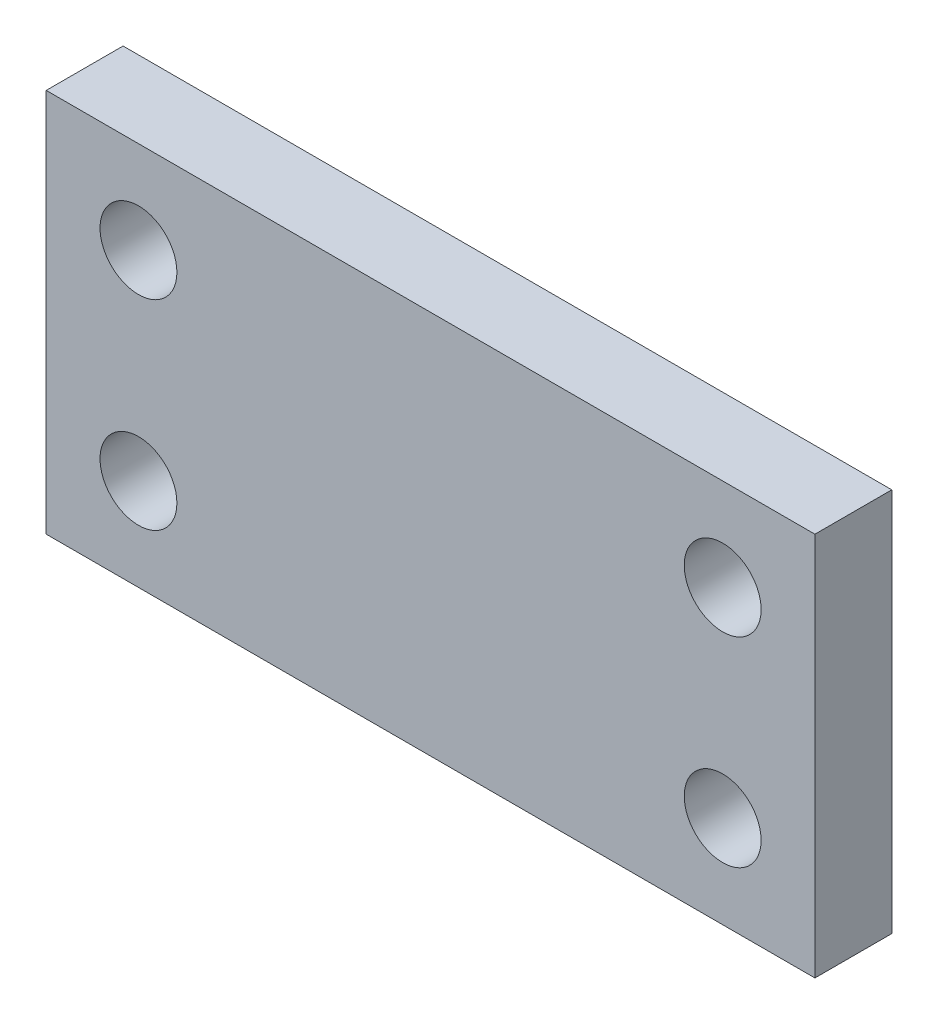
ISO-10303-21;
HEADER;
FILE_DESCRIPTION(('STEP AP214'),'2;1');
FILE_NAME('part.step','',(''),(''),'','','');
FILE_SCHEMA(('AUTOMOTIVE_DESIGN { 1 0 10303 214 1 1 1 1 }'));
ENDSEC;
DATA;
#1=APPLICATION_CONTEXT('core data for automotive mechanical design processes');
#2=APPLICATION_PROTOCOL_DEFINITION('international standard','automotive_design',2000,#1);
#3=PRODUCT_CONTEXT('',#1,'mechanical');
#4=PRODUCT('Part','Part','',(#3));
#5=PRODUCT_RELATED_PRODUCT_CATEGORY('part','',(#4));
#6=PRODUCT_DEFINITION_FORMATION('','',#4);
#7=PRODUCT_DEFINITION_CONTEXT('part definition',#1,'design');
#8=PRODUCT_DEFINITION('design','',#6,#7);
#9=PRODUCT_DEFINITION_SHAPE('','',#8);
#10=(LENGTH_UNIT() NAMED_UNIT(*) SI_UNIT(.MILLI.,.METRE.));
#11=(NAMED_UNIT(*) PLANE_ANGLE_UNIT() SI_UNIT($,.RADIAN.));
#12=(NAMED_UNIT(*) SI_UNIT($,.STERADIAN.) SOLID_ANGLE_UNIT());
#13=UNCERTAINTY_MEASURE_WITH_UNIT(LENGTH_MEASURE(1.E-05),#10,'distance_accuracy_value','');
#14=(GEOMETRIC_REPRESENTATION_CONTEXT(3) GLOBAL_UNCERTAINTY_ASSIGNED_CONTEXT((#13)) GLOBAL_UNIT_ASSIGNED_CONTEXT((#10,
#11,#12)) REPRESENTATION_CONTEXT('',''));
#15=CARTESIAN_POINT('',(0.,0.,0.));
#16=DIRECTION('',(0.,0.,1.));
#17=DIRECTION('',(1.,0.,0.));
#18=AXIS2_PLACEMENT_3D('',#15,#16,#17);
#19=CARTESIAN_POINT('',(0.,0.,10.));
#20=DIRECTION('',(0.,0.,-1.));
#21=DIRECTION('',(-1.,0.,0.));
#22=AXIS2_PLACEMENT_3D('',#19,#20,#21);
#23=PLANE('',#22);
#24=DIRECTION('',(0.,-1.,0.));
#25=VECTOR('',#24,1.);
#26=CARTESIAN_POINT('',(0.,0.,10.));
#27=LINE('',#26,#25);
#28=CARTESIAN_POINT('',(0.,50.,10.));
#29=VERTEX_POINT('',#28);
#30=CARTESIAN_POINT('',(0.,0.,10.));
#31=VERTEX_POINT('',#30);
#32=EDGE_CURVE('E85',#29,#31,#27,.T.);
#33=ORIENTED_EDGE('',*,*,#32,.T.);
#34=DIRECTION('',(1.,0.,0.));
#35=VECTOR('',#34,1.);
#36=CARTESIAN_POINT('',(0.,0.,10.));
#37=LINE('',#36,#35);
#38=CARTESIAN_POINT('',(100.,0.,10.));
#39=VERTEX_POINT('',#38);
#40=EDGE_CURVE('E80',#31,#39,#37,.T.);
#41=ORIENTED_EDGE('',*,*,#40,.T.);
#42=DIRECTION('',(0.,1.,0.));
#43=VECTOR('',#42,1.);
#44=CARTESIAN_POINT('',(100.,0.,10.));
#45=LINE('',#44,#43);
#46=CARTESIAN_POINT('',(100.,50.,10.));
#47=VERTEX_POINT('',#46);
#48=EDGE_CURVE('E83',#39,#47,#45,.T.);
#49=ORIENTED_EDGE('',*,*,#48,.T.);
#50=DIRECTION('',(-1.,0.,0.));
#51=VECTOR('',#50,1.);
#52=CARTESIAN_POINT('',(0.,50.,10.));
#53=LINE('',#52,#51);
#54=EDGE_CURVE('E50',#47,#29,#53,.T.);
#55=ORIENTED_EDGE('',*,*,#54,.T.);
#56=EDGE_LOOP('',(#33,#41,#49,#55));
#57=FACE_BOUND('',#56,.T.);
#58=CARTESIAN_POINT('',(12.,38.,10.));
#59=DIRECTION('',(0.,0.,1.));
#60=DIRECTION('',(1.,0.,0.));
#61=AXIS2_PLACEMENT_3D('',#58,#59,#60);
#62=CIRCLE('',#61,5.);
#63=CARTESIAN_POINT('',(17.,38.,10.));
#64=VERTEX_POINT('',#63);
#65=EDGE_CURVE('E100',#64,#64,#62,.T.);
#66=ORIENTED_EDGE('',*,*,#65,.F.);
#67=EDGE_LOOP('',(#66));
#68=FACE_BOUND('',#67,.T.);
#69=CARTESIAN_POINT('',(12.,12.,10.));
#70=DIRECTION('',(0.,0.,1.));
#71=DIRECTION('',(1.,0.,0.));
#72=AXIS2_PLACEMENT_3D('',#69,#70,#71);
#73=CIRCLE('',#72,5.);
#74=CARTESIAN_POINT('',(17.,12.,10.));
#75=VERTEX_POINT('',#74);
#76=EDGE_CURVE('E115',#75,#75,#73,.T.);
#77=ORIENTED_EDGE('',*,*,#76,.F.);
#78=EDGE_LOOP('',(#77));
#79=FACE_BOUND('',#78,.T.);
#80=CARTESIAN_POINT('',(88.,12.,10.));
#81=DIRECTION('',(0.,0.,1.));
#82=DIRECTION('',(1.,0.,0.));
#83=AXIS2_PLACEMENT_3D('',#80,#81,#82);
#84=CIRCLE('',#83,5.);
#85=CARTESIAN_POINT('',(93.,12.,10.));
#86=VERTEX_POINT('',#85);
#87=EDGE_CURVE('E121',#86,#86,#84,.T.);
#88=ORIENTED_EDGE('',*,*,#87,.F.);
#89=EDGE_LOOP('',(#88));
#90=FACE_BOUND('',#89,.T.);
#91=CARTESIAN_POINT('',(88.,38.,10.));
#92=DIRECTION('',(0.,0.,1.));
#93=DIRECTION('',(1.,0.,0.));
#94=AXIS2_PLACEMENT_3D('',#91,#92,#93);
#95=CIRCLE('',#94,5.00000000000001);
#96=CARTESIAN_POINT('',(93.,38.,10.));
#97=VERTEX_POINT('',#96);
#98=EDGE_CURVE('E127',#97,#97,#95,.T.);
#99=ORIENTED_EDGE('',*,*,#98,.F.);
#100=EDGE_LOOP('',(#99));
#101=FACE_BOUND('',#100,.T.);
#102=ADVANCED_FACE('F33',(#57,#68,#79,#90,#101),#23,.F.);
#103=CARTESIAN_POINT('',(0.,0.,0.));
#104=DIRECTION('',(0.,0.,-1.));
#105=DIRECTION('',(-1.,0.,0.));
#106=AXIS2_PLACEMENT_3D('',#103,#104,#105);
#107=PLANE('',#106);
#108=CARTESIAN_POINT('',(88.,12.,0.));
#109=DIRECTION('',(0.,0.,1.));
#110=DIRECTION('',(1.,0.,0.));
#111=AXIS2_PLACEMENT_3D('',#108,#109,#110);
#112=CIRCLE('',#111,5.);
#113=CARTESIAN_POINT('',(93.,12.,0.));
#114=VERTEX_POINT('',#113);
#115=EDGE_CURVE('E124',#114,#114,#112,.T.);
#116=ORIENTED_EDGE('',*,*,#115,.T.);
#117=EDGE_LOOP('',(#116));
#118=FACE_BOUND('',#117,.T.);
#119=CARTESIAN_POINT('',(12.,38.,0.));
#120=DIRECTION('',(0.,0.,1.));
#121=DIRECTION('',(1.,0.,0.));
#122=AXIS2_PLACEMENT_3D('',#119,#120,#121);
#123=CIRCLE('',#122,5.);
#124=CARTESIAN_POINT('',(17.,38.,0.));
#125=VERTEX_POINT('',#124);
#126=EDGE_CURVE('E112',#125,#125,#123,.T.);
#127=ORIENTED_EDGE('',*,*,#126,.T.);
#128=EDGE_LOOP('',(#127));
#129=FACE_BOUND('',#128,.T.);
#130=DIRECTION('',(0.,-1.,0.));
#131=VECTOR('',#130,1.);
#132=CARTESIAN_POINT('',(0.,0.,0.));
#133=LINE('',#132,#131);
#134=CARTESIAN_POINT('',(0.,50.,0.));
#135=VERTEX_POINT('',#134);
#136=CARTESIAN_POINT('',(0.,0.,0.));
#137=VERTEX_POINT('',#136);
#138=EDGE_CURVE('E97',#135,#137,#133,.T.);
#139=ORIENTED_EDGE('',*,*,#138,.F.);
#140=DIRECTION('',(-1.,0.,0.));
#141=VECTOR('',#140,1.);
#142=CARTESIAN_POINT('',(0.,50.,0.));
#143=LINE('',#142,#141);
#144=CARTESIAN_POINT('',(100.,50.,0.));
#145=VERTEX_POINT('',#144);
#146=EDGE_CURVE('E73',#145,#135,#143,.T.);
#147=ORIENTED_EDGE('',*,*,#146,.F.);
#148=DIRECTION('',(0.,1.,0.));
#149=VECTOR('',#148,1.);
#150=CARTESIAN_POINT('',(100.,0.,0.));
#151=LINE('',#150,#149);
#152=CARTESIAN_POINT('',(100.,0.,0.));
#153=VERTEX_POINT('',#152);
#154=EDGE_CURVE('E67',#153,#145,#151,.T.);
#155=ORIENTED_EDGE('',*,*,#154,.F.);
#156=DIRECTION('',(1.,0.,0.));
#157=VECTOR('',#156,1.);
#158=CARTESIAN_POINT('',(0.,0.,0.));
#159=LINE('',#158,#157);
#160=EDGE_CURVE('E89',#137,#153,#159,.T.);
#161=ORIENTED_EDGE('',*,*,#160,.F.);
#162=EDGE_LOOP('',(#139,#147,#155,#161));
#163=FACE_BOUND('',#162,.T.);
#164=CARTESIAN_POINT('',(12.,12.,0.));
#165=DIRECTION('',(0.,0.,1.));
#166=DIRECTION('',(1.,0.,0.));
#167=AXIS2_PLACEMENT_3D('',#164,#165,#166);
#168=CIRCLE('',#167,5.);
#169=CARTESIAN_POINT('',(17.,12.,0.));
#170=VERTEX_POINT('',#169);
#171=EDGE_CURVE('E118',#170,#170,#168,.T.);
#172=ORIENTED_EDGE('',*,*,#171,.T.);
#173=EDGE_LOOP('',(#172));
#174=FACE_BOUND('',#173,.T.);
#175=CARTESIAN_POINT('',(88.,38.,0.));
#176=DIRECTION('',(0.,0.,1.));
#177=DIRECTION('',(1.,0.,0.));
#178=AXIS2_PLACEMENT_3D('',#175,#176,#177);
#179=CIRCLE('',#178,5.00000000000001);
#180=CARTESIAN_POINT('',(93.,38.,0.));
#181=VERTEX_POINT('',#180);
#182=EDGE_CURVE('E130',#181,#181,#179,.T.);
#183=ORIENTED_EDGE('',*,*,#182,.T.);
#184=EDGE_LOOP('',(#183));
#185=FACE_BOUND('',#184,.T.);
#186=ADVANCED_FACE('F108',(#118,#129,#163,#174,#185),#107,.T.);
#187=CARTESIAN_POINT('',(0.,0.,10.));
#188=DIRECTION('',(1.,0.,0.));
#189=DIRECTION('',(0.,0.,-1.));
#190=AXIS2_PLACEMENT_3D('',#187,#188,#189);
#191=PLANE('',#190);
#192=ORIENTED_EDGE('',*,*,#138,.T.);
#193=DIRECTION('',(0.,0.,-1.));
#194=VECTOR('',#193,1.);
#195=CARTESIAN_POINT('',(0.,0.,10.));
#196=LINE('',#195,#194);
#197=EDGE_CURVE('E11',#31,#137,#196,.T.);
#198=ORIENTED_EDGE('',*,*,#197,.F.);
#199=ORIENTED_EDGE('',*,*,#32,.F.);
#200=DIRECTION('',(0.,0.,-1.));
#201=VECTOR('',#200,1.);
#202=CARTESIAN_POINT('',(0.,50.,10.));
#203=LINE('',#202,#201);
#204=EDGE_CURVE('E93',#29,#135,#203,.T.);
#205=ORIENTED_EDGE('',*,*,#204,.T.);
#206=EDGE_LOOP('',(#192,#198,#199,#205));
#207=FACE_BOUND('',#206,.T.);
#208=ADVANCED_FACE('F35',(#207),#191,.F.);
#209=CARTESIAN_POINT('',(0.,0.,10.));
#210=DIRECTION('',(0.,1.,0.));
#211=DIRECTION('',(0.,0.,1.));
#212=AXIS2_PLACEMENT_3D('',#209,#210,#211);
#213=PLANE('',#212);
#214=ORIENTED_EDGE('',*,*,#160,.T.);
#215=DIRECTION('',(0.,0.,-1.));
#216=VECTOR('',#215,1.);
#217=CARTESIAN_POINT('',(100.,0.,10.));
#218=LINE('',#217,#216);
#219=EDGE_CURVE('E42',#39,#153,#218,.T.);
#220=ORIENTED_EDGE('',*,*,#219,.F.);
#221=ORIENTED_EDGE('',*,*,#40,.F.);
#222=ORIENTED_EDGE('',*,*,#197,.T.);
#223=EDGE_LOOP('',(#214,#220,#221,#222));
#224=FACE_BOUND('',#223,.T.);
#225=ADVANCED_FACE('F88',(#224),#213,.F.);
#226=CARTESIAN_POINT('',(100.,0.,10.));
#227=DIRECTION('',(-1.,0.,0.));
#228=DIRECTION('',(0.,0.,1.));
#229=AXIS2_PLACEMENT_3D('',#226,#227,#228);
#230=PLANE('',#229);
#231=ORIENTED_EDGE('',*,*,#154,.T.);
#232=DIRECTION('',(0.,0.,-1.));
#233=VECTOR('',#232,1.);
#234=CARTESIAN_POINT('',(100.,50.,10.));
#235=LINE('',#234,#233);
#236=EDGE_CURVE('E90',#47,#145,#235,.T.);
#237=ORIENTED_EDGE('',*,*,#236,.F.);
#238=ORIENTED_EDGE('',*,*,#48,.F.);
#239=ORIENTED_EDGE('',*,*,#219,.T.);
#240=EDGE_LOOP('',(#231,#237,#238,#239));
#241=FACE_BOUND('',#240,.T.);
#242=ADVANCED_FACE('F91',(#241),#230,.F.);
#243=CARTESIAN_POINT('',(0.,50.,10.));
#244=DIRECTION('',(0.,-1.,0.));
#245=DIRECTION('',(0.,0.,-1.));
#246=AXIS2_PLACEMENT_3D('',#243,#244,#245);
#247=PLANE('',#246);
#248=ORIENTED_EDGE('',*,*,#146,.T.);
#249=ORIENTED_EDGE('',*,*,#204,.F.);
#250=ORIENTED_EDGE('',*,*,#54,.F.);
#251=ORIENTED_EDGE('',*,*,#236,.T.);
#252=EDGE_LOOP('',(#248,#249,#250,#251));
#253=FACE_BOUND('',#252,.T.);
#254=ADVANCED_FACE('F105',(#253),#247,.F.);
#255=CARTESIAN_POINT('',(12.,38.,10.));
#256=DIRECTION('',(0.,0.,-1.));
#257=DIRECTION('',(-1.,0.,0.));
#258=AXIS2_PLACEMENT_3D('',#255,#256,#257);
#259=CYLINDRICAL_SURFACE('',#258,5.);
#260=ORIENTED_EDGE('',*,*,#65,.T.);
#261=EDGE_LOOP('',(#260));
#262=FACE_BOUND('',#261,.T.);
#263=ORIENTED_EDGE('',*,*,#126,.F.);
#264=EDGE_LOOP('',(#263));
#265=FACE_BOUND('',#264,.T.);
#266=ADVANCED_FACE('F147',(#262,#265),#259,.F.);
#267=CARTESIAN_POINT('',(12.,12.,10.));
#268=DIRECTION('',(0.,0.,-1.));
#269=DIRECTION('',(-1.,0.,0.));
#270=AXIS2_PLACEMENT_3D('',#267,#268,#269);
#271=CYLINDRICAL_SURFACE('',#270,5.);
#272=ORIENTED_EDGE('',*,*,#76,.T.);
#273=EDGE_LOOP('',(#272));
#274=FACE_BOUND('',#273,.T.);
#275=ORIENTED_EDGE('',*,*,#171,.F.);
#276=EDGE_LOOP('',(#275));
#277=FACE_BOUND('',#276,.T.);
#278=ADVANCED_FACE('F193',(#274,#277),#271,.F.);
#279=CARTESIAN_POINT('',(88.,12.,10.));
#280=DIRECTION('',(0.,0.,-1.));
#281=DIRECTION('',(-1.,0.,0.));
#282=AXIS2_PLACEMENT_3D('',#279,#280,#281);
#283=CYLINDRICAL_SURFACE('',#282,5.);
#284=ORIENTED_EDGE('',*,*,#87,.T.);
#285=EDGE_LOOP('',(#284));
#286=FACE_BOUND('',#285,.T.);
#287=ORIENTED_EDGE('',*,*,#115,.F.);
#288=EDGE_LOOP('',(#287));
#289=FACE_BOUND('',#288,.T.);
#290=ADVANCED_FACE('F201',(#286,#289),#283,.F.);
#291=CARTESIAN_POINT('',(88.,38.,10.));
#292=DIRECTION('',(0.,0.,-1.));
#293=DIRECTION('',(-1.,0.,0.));
#294=AXIS2_PLACEMENT_3D('',#291,#292,#293);
#295=CYLINDRICAL_SURFACE('',#294,5.00000000000001);
#296=ORIENTED_EDGE('',*,*,#98,.T.);
#297=EDGE_LOOP('',(#296));
#298=FACE_BOUND('',#297,.T.);
#299=ORIENTED_EDGE('',*,*,#182,.F.);
#300=EDGE_LOOP('',(#299));
#301=FACE_BOUND('',#300,.T.);
#302=ADVANCED_FACE('F136',(#298,#301),#295,.F.);
#303=CLOSED_SHELL('',(#102,#186,#208,#225,#242,#254,#266,#278,#290,#302));
#304=MANIFOLD_SOLID_BREP('B2',#303);
#305=ADVANCED_BREP_SHAPE_REPRESENTATION('',(#18,#304),#14);
#306=SHAPE_DEFINITION_REPRESENTATION(#9,#305);
ENDSEC;
END-ISO-10303-21;
